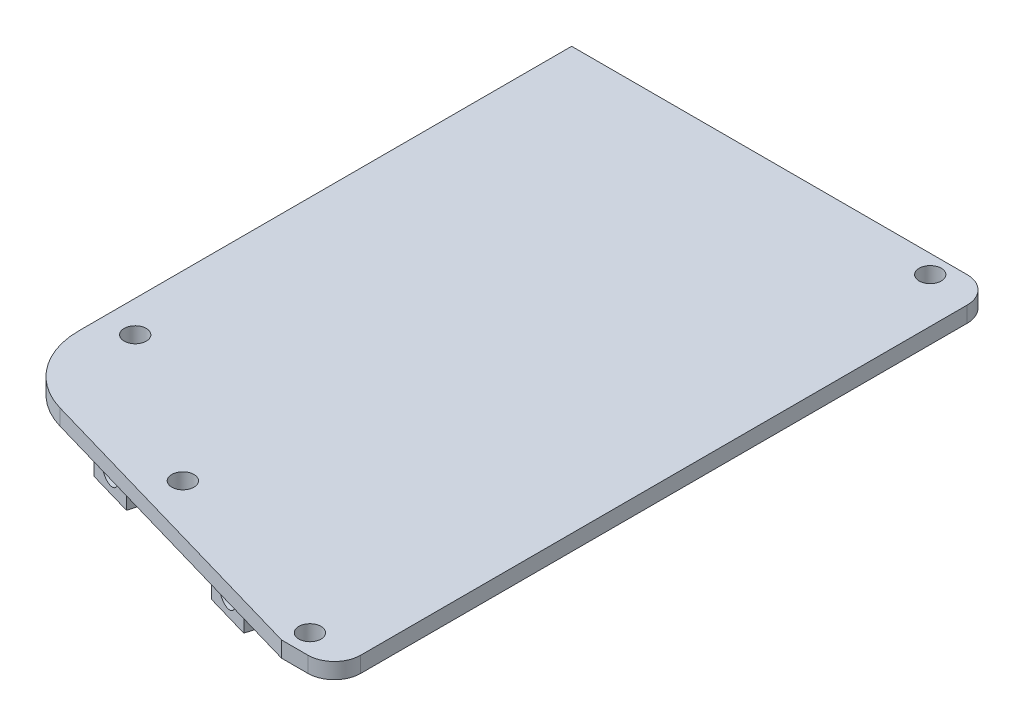
ISO-10303-21;
HEADER;
FILE_DESCRIPTION(('STEP AP214'),'2;1');
FILE_NAME('part.step','',(''),(''),'','','');
FILE_SCHEMA(('AUTOMOTIVE_DESIGN { 1 0 10303 214 1 1 1 1 }'));
ENDSEC;
DATA;
#1=APPLICATION_CONTEXT('core data for automotive mechanical design processes');
#2=APPLICATION_PROTOCOL_DEFINITION('international standard','automotive_design',2000,#1);
#3=PRODUCT_CONTEXT('',#1,'mechanical');
#4=PRODUCT('Part','Part','',(#3));
#5=PRODUCT_RELATED_PRODUCT_CATEGORY('part','',(#4));
#6=PRODUCT_DEFINITION_FORMATION('','',#4);
#7=PRODUCT_DEFINITION_CONTEXT('part definition',#1,'design');
#8=PRODUCT_DEFINITION('design','',#6,#7);
#9=PRODUCT_DEFINITION_SHAPE('','',#8);
#10=(LENGTH_UNIT() NAMED_UNIT(*) SI_UNIT(.MILLI.,.METRE.));
#11=(NAMED_UNIT(*) PLANE_ANGLE_UNIT() SI_UNIT($,.RADIAN.));
#12=(NAMED_UNIT(*) SI_UNIT($,.STERADIAN.) SOLID_ANGLE_UNIT());
#13=UNCERTAINTY_MEASURE_WITH_UNIT(LENGTH_MEASURE(1.E-05),#10,'distance_accuracy_value','');
#14=(GEOMETRIC_REPRESENTATION_CONTEXT(3) GLOBAL_UNCERTAINTY_ASSIGNED_CONTEXT((#13)) GLOBAL_UNIT_ASSIGNED_CONTEXT((#10,
#11,#12)) REPRESENTATION_CONTEXT('',''));
#15=CARTESIAN_POINT('',(0.,0.,0.));
#16=DIRECTION('',(0.,0.,1.));
#17=DIRECTION('',(1.,0.,0.));
#18=AXIS2_PLACEMENT_3D('',#15,#16,#17);
#19=CARTESIAN_POINT('',(-36.2211604368915,-3.5,-95.5775565994307));
#20=DIRECTION('',(0.,0.,1.));
#21=DIRECTION('',(1.,0.,0.));
#22=AXIS2_PLACEMENT_3D('',#19,#20,#21);
#23=CYLINDRICAL_SURFACE('',#22,2.2);
#24=CARTESIAN_POINT('',(-36.2211604368915,-3.5,-87.5775565994307));
#25=DIRECTION('',(0.,0.,1.));
#26=DIRECTION('',(1.,0.,0.));
#27=AXIS2_PLACEMENT_3D('',#24,#25,#26);
#28=CIRCLE('',#27,2.2);
#29=CARTESIAN_POINT('',(-34.0211604368915,-3.5,-87.5775565994307));
#30=VERTEX_POINT('',#29);
#31=EDGE_CURVE('E288',#30,#30,#28,.F.);
#32=ORIENTED_EDGE('',*,*,#31,.F.);
#33=EDGE_LOOP('',(#32));
#34=FACE_BOUND('',#33,.T.);
#35=CARTESIAN_POINT('',(-36.2211604368915,-3.5,-95.5775565994307));
#36=DIRECTION('',(0.,0.,1.));
#37=DIRECTION('',(1.,0.,0.));
#38=AXIS2_PLACEMENT_3D('',#35,#36,#37);
#39=CIRCLE('',#38,2.2);
#40=CARTESIAN_POINT('',(-34.0211604368915,-3.5,-95.5775565994307));
#41=VERTEX_POINT('',#40);
#42=EDGE_CURVE('E20',#41,#41,#39,.T.);
#43=ORIENTED_EDGE('',*,*,#42,.F.);
#44=EDGE_LOOP('',(#43));
#45=FACE_BOUND('',#44,.T.);
#46=ADVANCED_FACE('F17',(#34,#45),#23,.F.);
#47=CARTESIAN_POINT('',(-36.2211604368915,-7.,-91.5775565994307));
#48=DIRECTION('',(0.,-1.,0.));
#49=DIRECTION('',(0.,0.,-1.));
#50=AXIS2_PLACEMENT_3D('',#47,#48,#49);
#51=PLANE('',#50);
#52=DIRECTION('',(1.,0.,0.));
#53=VECTOR('',#52,1.);
#54=CARTESIAN_POINT('',(-31.7211604368915,-7.,-87.5775565994307));
#55=LINE('',#54,#53);
#56=CARTESIAN_POINT('',(-40.7211604368915,-7.,-87.5775565994307));
#57=VERTEX_POINT('',#56);
#58=CARTESIAN_POINT('',(-31.7211604368915,-7.,-87.5775565994307));
#59=VERTEX_POINT('',#58);
#60=EDGE_CURVE('E204',#57,#59,#55,.T.);
#61=ORIENTED_EDGE('',*,*,#60,.F.);
#62=DIRECTION('',(0.,0.,1.));
#63=VECTOR('',#62,1.);
#64=CARTESIAN_POINT('',(-40.7211604368915,-7.,-87.5775565994307));
#65=LINE('',#64,#63);
#66=CARTESIAN_POINT('',(-40.7211604368915,-7.,-95.5775565994307));
#67=VERTEX_POINT('',#66);
#68=EDGE_CURVE('E193',#67,#57,#65,.T.);
#69=ORIENTED_EDGE('',*,*,#68,.F.);
#70=DIRECTION('',(-1.,0.,0.));
#71=VECTOR('',#70,1.);
#72=CARTESIAN_POINT('',(-40.7211604368915,-7.,-95.5775565994307));
#73=LINE('',#72,#71);
#74=CARTESIAN_POINT('',(-31.7211604368915,-7.,-95.5775565994307));
#75=VERTEX_POINT('',#74);
#76=EDGE_CURVE('E186',#75,#67,#73,.T.);
#77=ORIENTED_EDGE('',*,*,#76,.F.);
#78=DIRECTION('',(0.,0.,-1.));
#79=VECTOR('',#78,1.);
#80=CARTESIAN_POINT('',(-31.7211604368915,-7.,-95.5775565994307));
#81=LINE('',#80,#79);
#82=EDGE_CURVE('E190',#59,#75,#81,.T.);
#83=ORIENTED_EDGE('',*,*,#82,.F.);
#84=EDGE_LOOP('',(#61,#69,#77,#83));
#85=FACE_BOUND('',#84,.T.);
#86=ADVANCED_FACE('F188',(#85),#51,.T.);
#87=CARTESIAN_POINT('',(-40.2439473426353,-3.5,17.4907953480703));
#88=DIRECTION('',(0.2778678402913,0.,-0.960619312387508));
#89=DIRECTION('',(-0.960619312387508,0.,-0.2778678402913));
#90=AXIS2_PLACEMENT_3D('',#87,#88,#89);
#91=CYLINDRICAL_SURFACE('',#90,2.2);
#92=CARTESIAN_POINT('',(-38.0210046203049,-3.5,9.80584084897022));
#93=DIRECTION('',(0.2778678402913,0.,-0.960619312387508));
#94=DIRECTION('',(-0.960619312387508,0.,-0.2778678402913));
#95=AXIS2_PLACEMENT_3D('',#92,#93,#94);
#96=CIRCLE('',#95,2.2);
#97=CARTESIAN_POINT('',(-40.1343671075574,-3.5,9.19453160032936));
#98=VERTEX_POINT('',#97);
#99=EDGE_CURVE('E284',#98,#98,#96,.F.);
#100=ORIENTED_EDGE('',*,*,#99,.F.);
#101=EDGE_LOOP('',(#100));
#102=FACE_BOUND('',#101,.T.);
#103=CARTESIAN_POINT('',(-40.2439473426353,-3.5,17.4907953480703));
#104=DIRECTION('',(0.2778678402913,0.,-0.960619312387508));
#105=DIRECTION('',(-0.960619312387508,0.,-0.2778678402913));
#106=AXIS2_PLACEMENT_3D('',#103,#104,#105);
#107=CIRCLE('',#106,2.2);
#108=CARTESIAN_POINT('',(-42.3573098298878,-3.5,16.8794860994294));
#109=VERTEX_POINT('',#108);
#110=EDGE_CURVE('E279',#109,#109,#107,.T.);
#111=ORIENTED_EDGE('',*,*,#110,.F.);
#112=EDGE_LOOP('',(#111));
#113=FACE_BOUND('',#112,.T.);
#114=ADVANCED_FACE('F571',(#102,#113),#91,.F.);
#115=CARTESIAN_POINT('',(-39.1324759814701,-7.,13.6483180985203));
#116=DIRECTION('',(0.,-1.,0.));
#117=DIRECTION('',(0.,0.,-1.));
#118=AXIS2_PLACEMENT_3D('',#115,#116,#117);
#119=PLANE('',#118);
#120=DIRECTION('',(0.960619312387508,0.,0.2778678402913));
#121=VECTOR('',#120,1.);
#122=CARTESIAN_POINT('',(-35.9211604368915,-7.,18.7412006293812));
#123=LINE('',#122,#121);
#124=CARTESIAN_POINT('',(-44.5667342483791,-7.,16.2403900667594));
#125=VERTEX_POINT('',#124);
#126=CARTESIAN_POINT('',(-35.9211604368915,-7.,18.7412006293811));
#127=VERTEX_POINT('',#126);
#128=EDGE_CURVE('E308',#125,#127,#123,.T.);
#129=ORIENTED_EDGE('',*,*,#128,.F.);
#130=DIRECTION('',(-0.277867840291301,0.,0.960619312387508));
#131=VECTOR('',#130,1.);
#132=CARTESIAN_POINT('',(-44.5667342483791,-7.,16.2403900667594));
#133=LINE('',#132,#131);
#134=CARTESIAN_POINT('',(-42.3437915260487,-7.,8.55543556765939));
#135=VERTEX_POINT('',#134);
#136=EDGE_CURVE('E315',#135,#125,#133,.T.);
#137=ORIENTED_EDGE('',*,*,#136,.F.);
#138=DIRECTION('',(-0.960619312387508,0.,-0.2778678402913));
#139=VECTOR('',#138,1.);
#140=CARTESIAN_POINT('',(-42.3437915260487,-7.,8.55543556765939));
#141=LINE('',#140,#139);
#142=CARTESIAN_POINT('',(-33.6982177145611,-7.,11.0562461302811));
#143=VERTEX_POINT('',#142);
#144=EDGE_CURVE('E287',#143,#135,#141,.T.);
#145=ORIENTED_EDGE('',*,*,#144,.F.);
#146=DIRECTION('',(0.2778678402913,0.,-0.960619312387508));
#147=VECTOR('',#146,1.);
#148=CARTESIAN_POINT('',(-33.6982177145611,-7.,11.0562461302811));
#149=LINE('',#148,#147);
#150=EDGE_CURVE('E286',#127,#143,#149,.T.);
#151=ORIENTED_EDGE('',*,*,#150,.F.);
#152=EDGE_LOOP('',(#129,#137,#145,#151));
#153=FACE_BOUND('',#152,.T.);
#154=ADVANCED_FACE('F567',(#153),#119,.T.);
#155=CARTESIAN_POINT('',(-83.9711604368915,-7.,-46.8785565994307));
#156=DIRECTION('',(0.,-1.,0.));
#157=DIRECTION('',(0.,0.,-1.));
#158=AXIS2_PLACEMENT_3D('',#155,#156,#157);
#159=PLANE('',#158);
#160=DIRECTION('',(-1.,0.,0.));
#161=VECTOR('',#160,1.);
#162=CARTESIAN_POINT('',(-87.9711604368915,-7.,-51.3785565994307));
#163=LINE('',#162,#161);
#164=CARTESIAN_POINT('',(-79.9711604368915,-7.,-51.3785565994307));
#165=VERTEX_POINT('',#164);
#166=CARTESIAN_POINT('',(-87.9711604368915,-7.,-51.3785565994307));
#167=VERTEX_POINT('',#166);
#168=EDGE_CURVE('E277',#165,#167,#163,.T.);
#169=ORIENTED_EDGE('',*,*,#168,.F.);
#170=DIRECTION('',(0.,0.,-1.));
#171=VECTOR('',#170,1.);
#172=CARTESIAN_POINT('',(-79.9711604368915,-7.,-51.3785565994307));
#173=LINE('',#172,#171);
#174=CARTESIAN_POINT('',(-79.9711604368915,-7.,-42.3785565994307));
#175=VERTEX_POINT('',#174);
#176=EDGE_CURVE('E336',#175,#165,#173,.T.);
#177=ORIENTED_EDGE('',*,*,#176,.F.);
#178=DIRECTION('',(1.,0.,0.));
#179=VECTOR('',#178,1.);
#180=CARTESIAN_POINT('',(-79.9711604368915,-7.,-42.3785565994307));
#181=LINE('',#180,#179);
#182=CARTESIAN_POINT('',(-87.9711604368915,-7.,-42.3785565994307));
#183=VERTEX_POINT('',#182);
#184=EDGE_CURVE('E321',#183,#175,#181,.T.);
#185=ORIENTED_EDGE('',*,*,#184,.F.);
#186=DIRECTION('',(0.,0.,1.));
#187=VECTOR('',#186,1.);
#188=CARTESIAN_POINT('',(-87.9711604368915,-7.,-42.3785565994307));
#189=LINE('',#188,#187);
#190=EDGE_CURVE('E323',#167,#183,#189,.T.);
#191=ORIENTED_EDGE('',*,*,#190,.F.);
#192=EDGE_LOOP('',(#169,#177,#185,#191));
#193=FACE_BOUND('',#192,.T.);
#194=ADVANCED_FACE('F563',(#193),#159,.T.);
#195=CARTESIAN_POINT('',(-87.9711604368915,-3.5,-46.8785565994307));
#196=DIRECTION('',(1.,0.,0.));
#197=DIRECTION('',(0.,0.,-1.));
#198=AXIS2_PLACEMENT_3D('',#195,#196,#197);
#199=CYLINDRICAL_SURFACE('',#198,2.2);
#200=CARTESIAN_POINT('',(-79.9711604368915,-3.5,-46.8785565994307));
#201=DIRECTION('',(1.,0.,0.));
#202=DIRECTION('',(0.,0.,-1.));
#203=AXIS2_PLACEMENT_3D('',#200,#201,#202);
#204=CIRCLE('',#203,2.2);
#205=CARTESIAN_POINT('',(-79.9711604368915,-3.5,-49.0785565994307));
#206=VERTEX_POINT('',#205);
#207=EDGE_CURVE('E270',#206,#206,#204,.F.);
#208=ORIENTED_EDGE('',*,*,#207,.F.);
#209=EDGE_LOOP('',(#208));
#210=FACE_BOUND('',#209,.T.);
#211=CARTESIAN_POINT('',(-87.9711604368915,-3.5,-46.8785565994307));
#212=DIRECTION('',(1.,0.,0.));
#213=DIRECTION('',(0.,0.,-1.));
#214=AXIS2_PLACEMENT_3D('',#211,#212,#213);
#215=CIRCLE('',#214,2.2);
#216=CARTESIAN_POINT('',(-87.9711604368915,-3.5,-49.0785565994307));
#217=VERTEX_POINT('',#216);
#218=EDGE_CURVE('E274',#217,#217,#215,.T.);
#219=ORIENTED_EDGE('',*,*,#218,.F.);
#220=EDGE_LOOP('',(#219));
#221=FACE_BOUND('',#220,.T.);
#222=ADVANCED_FACE('F559',(#210,#221),#199,.F.);
#223=CARTESIAN_POINT('',(-71.5439473426353,-3.5,8.43698673839156));
#224=DIRECTION('',(0.2778678402913,0.,-0.960619312387508));
#225=DIRECTION('',(-0.960619312387508,0.,-0.2778678402913));
#226=AXIS2_PLACEMENT_3D('',#223,#224,#225);
#227=CYLINDRICAL_SURFACE('',#226,2.2);
#228=CARTESIAN_POINT('',(-69.3210046203049,-3.5,0.752032239291493));
#229=DIRECTION('',(0.2778678402913,0.,-0.960619312387508));
#230=DIRECTION('',(-0.960619312387508,0.,-0.2778678402913));
#231=AXIS2_PLACEMENT_3D('',#228,#229,#230);
#232=CIRCLE('',#231,2.2);
#233=CARTESIAN_POINT('',(-71.4343671075574,-3.5,0.140722990650632));
#234=VERTEX_POINT('',#233);
#235=EDGE_CURVE('E265',#234,#234,#232,.F.);
#236=ORIENTED_EDGE('',*,*,#235,.F.);
#237=EDGE_LOOP('',(#236));
#238=FACE_BOUND('',#237,.T.);
#239=CARTESIAN_POINT('',(-71.5439473426353,-3.5,8.43698673839156));
#240=DIRECTION('',(0.2778678402913,0.,-0.960619312387508));
#241=DIRECTION('',(-0.960619312387508,0.,-0.2778678402913));
#242=AXIS2_PLACEMENT_3D('',#239,#240,#241);
#243=CIRCLE('',#242,2.2);
#244=CARTESIAN_POINT('',(-73.6573098298878,-3.5,7.8256774897507));
#245=VERTEX_POINT('',#244);
#246=EDGE_CURVE('E260',#245,#245,#243,.T.);
#247=ORIENTED_EDGE('',*,*,#246,.F.);
#248=EDGE_LOOP('',(#247));
#249=FACE_BOUND('',#248,.T.);
#250=ADVANCED_FACE('F555',(#238,#249),#227,.F.);
#251=CARTESIAN_POINT('',(-70.4324759814701,-7.,4.59450948884153));
#252=DIRECTION('',(0.,-1.,0.));
#253=DIRECTION('',(0.,0.,-1.));
#254=AXIS2_PLACEMENT_3D('',#251,#252,#253);
#255=PLANE('',#254);
#256=DIRECTION('',(0.960619312387508,0.,0.2778678402913));
#257=VECTOR('',#256,1.);
#258=CARTESIAN_POINT('',(-67.2211604368915,-7.,9.68739201970241));
#259=LINE('',#258,#257);
#260=CARTESIAN_POINT('',(-75.8667342483791,-7.,7.18658145708071));
#261=VERTEX_POINT('',#260);
#262=CARTESIAN_POINT('',(-67.2211604368915,-7.,9.68739201970241));
#263=VERTEX_POINT('',#262);
#264=EDGE_CURVE('E347',#261,#263,#259,.T.);
#265=ORIENTED_EDGE('',*,*,#264,.F.);
#266=DIRECTION('',(-0.2778678402913,0.,0.960619312387508));
#267=VECTOR('',#266,1.);
#268=CARTESIAN_POINT('',(-75.8667342483791,-7.,7.18658145708071));
#269=LINE('',#268,#267);
#270=CARTESIAN_POINT('',(-73.6437915260487,-7.,-0.498373042019354));
#271=VERTEX_POINT('',#270);
#272=EDGE_CURVE('E353',#271,#261,#269,.T.);
#273=ORIENTED_EDGE('',*,*,#272,.F.);
#274=DIRECTION('',(-0.960619312387508,0.,-0.2778678402913));
#275=VECTOR('',#274,1.);
#276=CARTESIAN_POINT('',(-73.6437915260487,-7.,-0.498373042019354));
#277=LINE('',#276,#275);
#278=CARTESIAN_POINT('',(-64.9982177145611,-7.,2.00243752060235));
#279=VERTEX_POINT('',#278);
#280=EDGE_CURVE('E269',#279,#271,#277,.T.);
#281=ORIENTED_EDGE('',*,*,#280,.F.);
#282=DIRECTION('',(0.277867840291299,0.,-0.960619312387508));
#283=VECTOR('',#282,1.);
#284=CARTESIAN_POINT('',(-64.9982177145611,-7.,2.00243752060235));
#285=LINE('',#284,#283);
#286=EDGE_CURVE('E268',#263,#279,#285,.T.);
#287=ORIENTED_EDGE('',*,*,#286,.F.);
#288=EDGE_LOOP('',(#265,#273,#281,#287));
#289=FACE_BOUND('',#288,.T.);
#290=ADVANCED_FACE('F551',(#289),#255,.T.);
#291=CARTESIAN_POINT('',(-40.7211604368915,0.,-95.5775565994307));
#292=DIRECTION('',(0.,0.,-1.));
#293=DIRECTION('',(-1.,0.,0.));
#294=AXIS2_PLACEMENT_3D('',#291,#292,#293);
#295=PLANE('',#294);
#296=ORIENTED_EDGE('',*,*,#42,.T.);
#297=EDGE_LOOP('',(#296));
#298=FACE_BOUND('',#297,.T.);
#299=ORIENTED_EDGE('',*,*,#76,.T.);
#300=DIRECTION('',(0.,1.,0.));
#301=VECTOR('',#300,1.);
#302=CARTESIAN_POINT('',(-40.7211604368915,0.,-95.5775565994307));
#303=LINE('',#302,#301);
#304=CARTESIAN_POINT('',(-40.7211604368915,0.,-95.5775565994307));
#305=VERTEX_POINT('',#304);
#306=EDGE_CURVE('E290',#305,#67,#303,.F.);
#307=ORIENTED_EDGE('',*,*,#306,.F.);
#308=DIRECTION('',(1.,0.,0.));
#309=VECTOR('',#308,1.);
#310=CARTESIAN_POINT('',(-51.2211604368915,0.,-95.5775565994307));
#311=LINE('',#310,#309);
#312=CARTESIAN_POINT('',(-31.7211604368915,0.,-95.5775565994307));
#313=VERTEX_POINT('',#312);
#314=EDGE_CURVE('E201',#305,#313,#311,.T.);
#315=ORIENTED_EDGE('',*,*,#314,.T.);
#316=DIRECTION('',(0.,1.,0.));
#317=VECTOR('',#316,1.);
#318=CARTESIAN_POINT('',(-31.7211604368915,0.,-95.5775565994307));
#319=LINE('',#318,#317);
#320=EDGE_CURVE('E198',#75,#313,#319,.T.);
#321=ORIENTED_EDGE('',*,*,#320,.F.);
#322=EDGE_LOOP('',(#299,#307,#315,#321));
#323=FACE_BOUND('',#322,.T.);
#324=ADVANCED_FACE('F199',(#298,#323),#295,.T.);
#325=CARTESIAN_POINT('',(-31.7211604368915,0.,-95.5775565994307));
#326=DIRECTION('',(1.,0.,0.));
#327=DIRECTION('',(0.,0.,-1.));
#328=AXIS2_PLACEMENT_3D('',#325,#326,#327);
#329=PLANE('',#328);
#330=ORIENTED_EDGE('',*,*,#82,.T.);
#331=ORIENTED_EDGE('',*,*,#320,.T.);
#332=DIRECTION('',(0.,0.,1.));
#333=VECTOR('',#332,1.);
#334=CARTESIAN_POINT('',(-31.7211604368915,0.,-36.2275565994307));
#335=LINE('',#334,#333);
#336=CARTESIAN_POINT('',(-31.7211604368915,0.,-87.5775565994307));
#337=VERTEX_POINT('',#336);
#338=EDGE_CURVE('E383',#313,#337,#335,.T.);
#339=ORIENTED_EDGE('',*,*,#338,.T.);
#340=DIRECTION('',(0.,1.,0.));
#341=VECTOR('',#340,1.);
#342=CARTESIAN_POINT('',(-31.7211604368915,0.,-87.5775565994307));
#343=LINE('',#342,#341);
#344=EDGE_CURVE('E208',#59,#337,#343,.T.);
#345=ORIENTED_EDGE('',*,*,#344,.F.);
#346=EDGE_LOOP('',(#330,#331,#339,#345));
#347=FACE_BOUND('',#346,.T.);
#348=ADVANCED_FACE('F206',(#347),#329,.T.);
#349=CARTESIAN_POINT('',(-31.7211604368915,0.,-87.5775565994307));
#350=DIRECTION('',(0.,0.,1.));
#351=DIRECTION('',(1.,0.,0.));
#352=AXIS2_PLACEMENT_3D('',#349,#350,#351);
#353=PLANE('',#352);
#354=ORIENTED_EDGE('',*,*,#31,.T.);
#355=EDGE_LOOP('',(#354));
#356=FACE_BOUND('',#355,.T.);
#357=ORIENTED_EDGE('',*,*,#60,.T.);
#358=ORIENTED_EDGE('',*,*,#344,.T.);
#359=DIRECTION('',(1.,0.,0.));
#360=VECTOR('',#359,1.);
#361=CARTESIAN_POINT('',(-51.2211604368915,0.,-87.5775565994307));
#362=LINE('',#361,#360);
#363=CARTESIAN_POINT('',(-40.7211604368915,0.,-87.5775565994307));
#364=VERTEX_POINT('',#363);
#365=EDGE_CURVE('E385',#337,#364,#362,.F.);
#366=ORIENTED_EDGE('',*,*,#365,.T.);
#367=DIRECTION('',(0.,1.,0.));
#368=VECTOR('',#367,1.);
#369=CARTESIAN_POINT('',(-40.7211604368915,0.,-87.5775565994307));
#370=LINE('',#369,#368);
#371=EDGE_CURVE('E299',#57,#364,#370,.T.);
#372=ORIENTED_EDGE('',*,*,#371,.F.);
#373=EDGE_LOOP('',(#357,#358,#366,#372));
#374=FACE_BOUND('',#373,.T.);
#375=ADVANCED_FACE('F531',(#356,#374),#353,.T.);
#376=CARTESIAN_POINT('',(-40.7211604368915,0.,-87.5775565994307));
#377=DIRECTION('',(-1.,0.,0.));
#378=DIRECTION('',(0.,0.,1.));
#379=AXIS2_PLACEMENT_3D('',#376,#377,#378);
#380=PLANE('',#379);
#381=ORIENTED_EDGE('',*,*,#68,.T.);
#382=ORIENTED_EDGE('',*,*,#371,.T.);
#383=DIRECTION('',(0.,0.,1.));
#384=VECTOR('',#383,1.);
#385=CARTESIAN_POINT('',(-40.7211604368915,0.,-36.2275565994307));
#386=LINE('',#385,#384);
#387=EDGE_CURVE('E387',#364,#305,#386,.F.);
#388=ORIENTED_EDGE('',*,*,#387,.T.);
#389=ORIENTED_EDGE('',*,*,#306,.T.);
#390=EDGE_LOOP('',(#381,#382,#388,#389));
#391=FACE_BOUND('',#390,.T.);
#392=ADVANCED_FACE('F533',(#391),#380,.T.);
#393=CARTESIAN_POINT('',(-42.3437915260487,0.,8.55543556765939));
#394=DIRECTION('',(0.2778678402913,0.,-0.960619312387508));
#395=DIRECTION('',(-0.960619312387508,0.,-0.2778678402913));
#396=AXIS2_PLACEMENT_3D('',#393,#394,#395);
#397=PLANE('',#396);
#398=ORIENTED_EDGE('',*,*,#99,.T.);
#399=EDGE_LOOP('',(#398));
#400=FACE_BOUND('',#399,.T.);
#401=ORIENTED_EDGE('',*,*,#144,.T.);
#402=DIRECTION('',(0.,1.,0.));
#403=VECTOR('',#402,1.);
#404=CARTESIAN_POINT('',(-42.3437915260487,0.,8.55543556765939));
#405=LINE('',#404,#403);
#406=CARTESIAN_POINT('',(-42.3437915260487,0.,8.55543556765939));
#407=VERTEX_POINT('',#406);
#408=EDGE_CURVE('E282',#407,#135,#405,.F.);
#409=ORIENTED_EDGE('',*,*,#408,.F.);
#410=DIRECTION('',(0.960619312387508,0.,0.2778678402913));
#411=VECTOR('',#410,1.);
#412=CARTESIAN_POINT('',(-42.3437915260487,0.,8.55543556765939));
#413=LINE('',#412,#411);
#414=CARTESIAN_POINT('',(-33.6982177145611,0.,11.0562461302811));
#415=VERTEX_POINT('',#414);
#416=EDGE_CURVE('E390',#407,#415,#413,.T.);
#417=ORIENTED_EDGE('',*,*,#416,.T.);
#418=DIRECTION('',(0.,1.,0.));
#419=VECTOR('',#418,1.);
#420=CARTESIAN_POINT('',(-33.6982177145611,0.,11.0562461302811));
#421=LINE('',#420,#419);
#422=EDGE_CURVE('E305',#143,#415,#421,.T.);
#423=ORIENTED_EDGE('',*,*,#422,.F.);
#424=EDGE_LOOP('',(#401,#409,#417,#423));
#425=FACE_BOUND('',#424,.T.);
#426=ADVANCED_FACE('F535',(#400,#425),#397,.T.);
#427=CARTESIAN_POINT('',(-33.6982177145611,0.,11.0562461302811));
#428=DIRECTION('',(0.960619312387508,0.,0.2778678402913));
#429=DIRECTION('',(0.2778678402913,0.,-0.960619312387508));
#430=AXIS2_PLACEMENT_3D('',#427,#428,#429);
#431=PLANE('',#430);
#432=ORIENTED_EDGE('',*,*,#150,.T.);
#433=ORIENTED_EDGE('',*,*,#422,.T.);
#434=DIRECTION('',(-0.277867840291297,0.,0.960619312387509));
#435=VECTOR('',#434,1.);
#436=CARTESIAN_POINT('',(-33.6982177145611,0.,11.0562461302811));
#437=LINE('',#436,#435);
#438=CARTESIAN_POINT('',(-35.9211604368915,0.,18.7412006293812));
#439=VERTEX_POINT('',#438);
#440=EDGE_CURVE('E392',#415,#439,#437,.T.);
#441=ORIENTED_EDGE('',*,*,#440,.T.);
#442=DIRECTION('',(0.,1.,0.));
#443=VECTOR('',#442,1.);
#444=CARTESIAN_POINT('',(-35.9211604368915,0.,18.7412006293812));
#445=LINE('',#444,#443);
#446=EDGE_CURVE('E283',#127,#439,#445,.T.);
#447=ORIENTED_EDGE('',*,*,#446,.F.);
#448=EDGE_LOOP('',(#432,#433,#441,#447));
#449=FACE_BOUND('',#448,.T.);
#450=ADVANCED_FACE('F541',(#449),#431,.T.);
#451=CARTESIAN_POINT('',(-35.9211604368915,0.,18.7412006293812));
#452=DIRECTION('',(-0.2778678402913,0.,0.960619312387508));
#453=DIRECTION('',(0.960619312387508,0.,0.2778678402913));
#454=AXIS2_PLACEMENT_3D('',#451,#452,#453);
#455=PLANE('',#454);
#456=ORIENTED_EDGE('',*,*,#110,.T.);
#457=EDGE_LOOP('',(#456));
#458=FACE_BOUND('',#457,.T.);
#459=ORIENTED_EDGE('',*,*,#128,.T.);
#460=ORIENTED_EDGE('',*,*,#446,.T.);
#461=DIRECTION('',(-0.960619312387505,0.,-0.277867840291309));
#462=VECTOR('',#461,1.);
#463=CARTESIAN_POINT('',(-35.9211604368915,0.,18.7412006293812));
#464=LINE('',#463,#462);
#465=CARTESIAN_POINT('',(-44.5667342483791,0.,16.2403900667594));
#466=VERTEX_POINT('',#465);
#467=EDGE_CURVE('E394',#439,#466,#464,.T.);
#468=ORIENTED_EDGE('',*,*,#467,.T.);
#469=DIRECTION('',(0.,1.,0.));
#470=VECTOR('',#469,1.);
#471=CARTESIAN_POINT('',(-44.5667342483791,0.,16.2403900667594));
#472=LINE('',#471,#470);
#473=EDGE_CURVE('E318',#125,#466,#472,.T.);
#474=ORIENTED_EDGE('',*,*,#473,.F.);
#475=EDGE_LOOP('',(#459,#460,#468,#474));
#476=FACE_BOUND('',#475,.T.);
#477=ADVANCED_FACE('F666',(#458,#476),#455,.T.);
#478=CARTESIAN_POINT('',(-44.5667342483791,0.,16.2403900667594));
#479=DIRECTION('',(-0.960619312387508,0.,-0.277867840291301));
#480=DIRECTION('',(-0.277867840291301,0.,0.960619312387508));
#481=AXIS2_PLACEMENT_3D('',#478,#479,#480);
#482=PLANE('',#481);
#483=ORIENTED_EDGE('',*,*,#136,.T.);
#484=ORIENTED_EDGE('',*,*,#473,.T.);
#485=DIRECTION('',(0.277867840291302,0.,-0.960619312387507));
#486=VECTOR('',#485,1.);
#487=CARTESIAN_POINT('',(-44.5667342483791,0.,16.2403900667594));
#488=LINE('',#487,#486);
#489=EDGE_CURVE('E396',#466,#407,#488,.T.);
#490=ORIENTED_EDGE('',*,*,#489,.T.);
#491=ORIENTED_EDGE('',*,*,#408,.T.);
#492=EDGE_LOOP('',(#483,#484,#490,#491));
#493=FACE_BOUND('',#492,.T.);
#494=ADVANCED_FACE('F675',(#493),#482,.T.);
#495=CARTESIAN_POINT('',(-79.9711604368915,0.,-42.3785565994307));
#496=DIRECTION('',(0.,0.,1.));
#497=DIRECTION('',(1.,0.,0.));
#498=AXIS2_PLACEMENT_3D('',#495,#496,#497);
#499=PLANE('',#498);
#500=ORIENTED_EDGE('',*,*,#184,.T.);
#501=DIRECTION('',(0.,1.,0.));
#502=VECTOR('',#501,1.);
#503=CARTESIAN_POINT('',(-79.9711604368915,0.,-42.3785565994307));
#504=LINE('',#503,#502);
#505=CARTESIAN_POINT('',(-79.9711604368915,0.,-42.3785565994307));
#506=VERTEX_POINT('',#505);
#507=EDGE_CURVE('E333',#506,#175,#504,.F.);
#508=ORIENTED_EDGE('',*,*,#507,.F.);
#509=DIRECTION('',(1.,0.,0.));
#510=VECTOR('',#509,1.);
#511=CARTESIAN_POINT('',(-51.2211604368915,0.,-42.3785565994307));
#512=LINE('',#511,#510);
#513=CARTESIAN_POINT('',(-87.9711604368915,0.,-42.3785565994307));
#514=VERTEX_POINT('',#513);
#515=EDGE_CURVE('E399',#506,#514,#512,.F.);
#516=ORIENTED_EDGE('',*,*,#515,.T.);
#517=DIRECTION('',(0.,1.,0.));
#518=VECTOR('',#517,1.);
#519=CARTESIAN_POINT('',(-87.9711604368915,0.,-42.3785565994307));
#520=LINE('',#519,#518);
#521=EDGE_CURVE('E278',#183,#514,#520,.T.);
#522=ORIENTED_EDGE('',*,*,#521,.F.);
#523=EDGE_LOOP('',(#500,#508,#516,#522));
#524=FACE_BOUND('',#523,.T.);
#525=ADVANCED_FACE('F685',(#524),#499,.T.);
#526=CARTESIAN_POINT('',(-87.9711604368915,0.,-42.3785565994307));
#527=DIRECTION('',(-1.,0.,0.));
#528=DIRECTION('',(0.,0.,1.));
#529=AXIS2_PLACEMENT_3D('',#526,#527,#528);
#530=PLANE('',#529);
#531=ORIENTED_EDGE('',*,*,#218,.T.);
#532=EDGE_LOOP('',(#531));
#533=FACE_BOUND('',#532,.T.);
#534=ORIENTED_EDGE('',*,*,#190,.T.);
#535=ORIENTED_EDGE('',*,*,#521,.T.);
#536=DIRECTION('',(0.,0.,1.));
#537=VECTOR('',#536,1.);
#538=CARTESIAN_POINT('',(-87.9711604368915,0.,-36.2275565994307));
#539=LINE('',#538,#537);
#540=CARTESIAN_POINT('',(-87.9711604368915,0.,-51.3785565994307));
#541=VERTEX_POINT('',#540);
#542=EDGE_CURVE('E401',#514,#541,#539,.F.);
#543=ORIENTED_EDGE('',*,*,#542,.T.);
#544=DIRECTION('',(0.,1.,0.));
#545=VECTOR('',#544,1.);
#546=CARTESIAN_POINT('',(-87.9711604368915,0.,-51.3785565994307));
#547=LINE('',#546,#545);
#548=EDGE_CURVE('E330',#167,#541,#547,.T.);
#549=ORIENTED_EDGE('',*,*,#548,.F.);
#550=EDGE_LOOP('',(#534,#535,#543,#549));
#551=FACE_BOUND('',#550,.T.);
#552=ADVANCED_FACE('F695',(#533,#551),#530,.T.);
#553=CARTESIAN_POINT('',(-87.9711604368915,0.,-51.3785565994307));
#554=DIRECTION('',(0.,0.,-1.));
#555=DIRECTION('',(-1.,0.,0.));
#556=AXIS2_PLACEMENT_3D('',#553,#554,#555);
#557=PLANE('',#556);
#558=ORIENTED_EDGE('',*,*,#168,.T.);
#559=ORIENTED_EDGE('',*,*,#548,.T.);
#560=DIRECTION('',(1.,0.,0.));
#561=VECTOR('',#560,1.);
#562=CARTESIAN_POINT('',(-51.2211604368915,0.,-51.3785565994307));
#563=LINE('',#562,#561);
#564=CARTESIAN_POINT('',(-79.9711604368915,0.,-51.3785565994307));
#565=VERTEX_POINT('',#564);
#566=EDGE_CURVE('E403',#541,#565,#563,.T.);
#567=ORIENTED_EDGE('',*,*,#566,.T.);
#568=DIRECTION('',(0.,1.,0.));
#569=VECTOR('',#568,1.);
#570=CARTESIAN_POINT('',(-79.9711604368915,0.,-51.3785565994307));
#571=LINE('',#570,#569);
#572=EDGE_CURVE('E273',#165,#565,#571,.T.);
#573=ORIENTED_EDGE('',*,*,#572,.F.);
#574=EDGE_LOOP('',(#558,#559,#567,#573));
#575=FACE_BOUND('',#574,.T.);
#576=ADVANCED_FACE('F705',(#575),#557,.T.);
#577=CARTESIAN_POINT('',(-79.9711604368915,0.,-51.3785565994307));
#578=DIRECTION('',(1.,0.,0.));
#579=DIRECTION('',(0.,0.,-1.));
#580=AXIS2_PLACEMENT_3D('',#577,#578,#579);
#581=PLANE('',#580);
#582=ORIENTED_EDGE('',*,*,#207,.T.);
#583=EDGE_LOOP('',(#582));
#584=FACE_BOUND('',#583,.T.);
#585=ORIENTED_EDGE('',*,*,#176,.T.);
#586=ORIENTED_EDGE('',*,*,#572,.T.);
#587=DIRECTION('',(0.,0.,1.));
#588=VECTOR('',#587,1.);
#589=CARTESIAN_POINT('',(-79.9711604368915,0.,-36.2275565994307));
#590=LINE('',#589,#588);
#591=EDGE_CURVE('E405',#565,#506,#590,.T.);
#592=ORIENTED_EDGE('',*,*,#591,.T.);
#593=ORIENTED_EDGE('',*,*,#507,.T.);
#594=EDGE_LOOP('',(#585,#586,#592,#593));
#595=FACE_BOUND('',#594,.T.);
#596=ADVANCED_FACE('F715',(#584,#595),#581,.T.);
#597=CARTESIAN_POINT('',(-73.6437915260487,0.,-0.498373042019354));
#598=DIRECTION('',(0.2778678402913,0.,-0.960619312387508));
#599=DIRECTION('',(-0.960619312387508,0.,-0.2778678402913));
#600=AXIS2_PLACEMENT_3D('',#597,#598,#599);
#601=PLANE('',#600);
#602=ORIENTED_EDGE('',*,*,#235,.T.);
#603=EDGE_LOOP('',(#602));
#604=FACE_BOUND('',#603,.T.);
#605=ORIENTED_EDGE('',*,*,#280,.T.);
#606=DIRECTION('',(0.,1.,0.));
#607=VECTOR('',#606,1.);
#608=CARTESIAN_POINT('',(-73.6437915260487,0.,-0.498373042019352));
#609=LINE('',#608,#607);
#610=CARTESIAN_POINT('',(-73.6437915260487,0.,-0.498373042019354));
#611=VERTEX_POINT('',#610);
#612=EDGE_CURVE('E263',#611,#271,#609,.F.);
#613=ORIENTED_EDGE('',*,*,#612,.F.);
#614=DIRECTION('',(0.960619312387508,0.,0.277867840291299));
#615=VECTOR('',#614,1.);
#616=CARTESIAN_POINT('',(-73.6437915260487,0.,-0.498373042019357));
#617=LINE('',#616,#615);
#618=CARTESIAN_POINT('',(-64.9982177145611,0.,2.00243752060235));
#619=VERTEX_POINT('',#618);
#620=EDGE_CURVE('E408',#611,#619,#617,.T.);
#621=ORIENTED_EDGE('',*,*,#620,.T.);
#622=DIRECTION('',(0.,1.,0.));
#623=VECTOR('',#622,1.);
#624=CARTESIAN_POINT('',(-64.9982177145611,0.,2.00243752060235));
#625=LINE('',#624,#623);
#626=EDGE_CURVE('E344',#279,#619,#625,.T.);
#627=ORIENTED_EDGE('',*,*,#626,.F.);
#628=EDGE_LOOP('',(#605,#613,#621,#627));
#629=FACE_BOUND('',#628,.T.);
#630=ADVANCED_FACE('F725',(#604,#629),#601,.T.);
#631=CARTESIAN_POINT('',(-64.9982177145611,0.,2.00243752060235));
#632=DIRECTION('',(0.960619312387508,0.,0.277867840291299));
#633=DIRECTION('',(0.277867840291299,0.,-0.960619312387508));
#634=AXIS2_PLACEMENT_3D('',#631,#632,#633);
#635=PLANE('',#634);
#636=ORIENTED_EDGE('',*,*,#286,.T.);
#637=ORIENTED_EDGE('',*,*,#626,.T.);
#638=DIRECTION('',(-0.277867840291301,0.,0.960619312387508));
#639=VECTOR('',#638,1.);
#640=CARTESIAN_POINT('',(-64.9982177145611,0.,2.00243752060235));
#641=LINE('',#640,#639);
#642=CARTESIAN_POINT('',(-67.2211604368915,0.,9.68739201970241));
#643=VERTEX_POINT('',#642);
#644=EDGE_CURVE('E410',#619,#643,#641,.T.);
#645=ORIENTED_EDGE('',*,*,#644,.T.);
#646=DIRECTION('',(0.,1.,0.));
#647=VECTOR('',#646,1.);
#648=CARTESIAN_POINT('',(-67.2211604368915,0.,9.68739201970241));
#649=LINE('',#648,#647);
#650=EDGE_CURVE('E264',#263,#643,#649,.T.);
#651=ORIENTED_EDGE('',*,*,#650,.F.);
#652=EDGE_LOOP('',(#636,#637,#645,#651));
#653=FACE_BOUND('',#652,.T.);
#654=ADVANCED_FACE('F735',(#653),#635,.T.);
#655=CARTESIAN_POINT('',(-67.2211604368915,0.,9.68739201970241));
#656=DIRECTION('',(-0.2778678402913,0.,0.960619312387508));
#657=DIRECTION('',(0.960619312387508,0.,0.2778678402913));
#658=AXIS2_PLACEMENT_3D('',#655,#656,#657);
#659=PLANE('',#658);
#660=ORIENTED_EDGE('',*,*,#246,.T.);
#661=EDGE_LOOP('',(#660));
#662=FACE_BOUND('',#661,.T.);
#663=ORIENTED_EDGE('',*,*,#264,.T.);
#664=ORIENTED_EDGE('',*,*,#650,.T.);
#665=DIRECTION('',(-0.960619312387508,0.,-0.277867840291299));
#666=VECTOR('',#665,1.);
#667=CARTESIAN_POINT('',(-67.2211604368915,0.,9.68739201970241));
#668=LINE('',#667,#666);
#669=CARTESIAN_POINT('',(-75.8667342483791,0.,7.18658145708071));
#670=VERTEX_POINT('',#669);
#671=EDGE_CURVE('E84',#643,#670,#668,.T.);
#672=ORIENTED_EDGE('',*,*,#671,.T.);
#673=DIRECTION('',(0.,1.,0.));
#674=VECTOR('',#673,1.);
#675=CARTESIAN_POINT('',(-75.8667342483791,0.,7.18658145708071));
#676=LINE('',#675,#674);
#677=EDGE_CURVE('E356',#261,#670,#676,.T.);
#678=ORIENTED_EDGE('',*,*,#677,.F.);
#679=EDGE_LOOP('',(#663,#664,#672,#678));
#680=FACE_BOUND('',#679,.T.);
#681=ADVANCED_FACE('F745',(#662,#680),#659,.T.);
#682=CARTESIAN_POINT('',(-75.8667342483791,0.,7.18658145708071));
#683=DIRECTION('',(-0.960619312387508,0.,-0.2778678402913));
#684=DIRECTION('',(-0.2778678402913,0.,0.960619312387508));
#685=AXIS2_PLACEMENT_3D('',#682,#683,#684);
#686=PLANE('',#685);
#687=ORIENTED_EDGE('',*,*,#272,.T.);
#688=ORIENTED_EDGE('',*,*,#677,.T.);
#689=DIRECTION('',(0.277867840291299,0.,-0.960619312387508));
#690=VECTOR('',#689,1.);
#691=CARTESIAN_POINT('',(-75.8667342483791,0.,7.18658145708071));
#692=LINE('',#691,#690);
#693=EDGE_CURVE('E375',#670,#611,#692,.T.);
#694=ORIENTED_EDGE('',*,*,#693,.T.);
#695=ORIENTED_EDGE('',*,*,#612,.T.);
#696=EDGE_LOOP('',(#687,#688,#694,#695));
#697=FACE_BOUND('',#696,.T.);
#698=ADVANCED_FACE('F515',(#697),#686,.T.);
#699=CARTESIAN_POINT('',(-51.2211604368915,0.,-36.2275565994307));
#700=DIRECTION('',(0.,1.,0.));
#701=DIRECTION('',(0.,0.,1.));
#702=AXIS2_PLACEMENT_3D('',#699,#700,#701);
#703=PLANE('',#702);
#704=CARTESIAN_POINT('',(-85.2211604368915,0.,-9.96855659943071));
#705=DIRECTION('',(0.,-1.,0.));
#706=DIRECTION('',(0.,0.,-1.));
#707=AXIS2_PLACEMENT_3D('',#704,#705,#706);
#708=CIRCLE('',#707,2.1);
#709=CARTESIAN_POINT('',(-85.2211604368915,0.,-12.0685565994307));
#710=VERTEX_POINT('',#709);
#711=EDGE_CURVE('E236',#710,#710,#708,.F.);
#712=ORIENTED_EDGE('',*,*,#711,.T.);
#713=EDGE_LOOP('',(#712));
#714=FACE_BOUND('',#713,.T.);
#715=CARTESIAN_POINT('',(-19.7211604368915,0.,-95.2275565994307));
#716=DIRECTION('',(0.,-1.,0.));
#717=DIRECTION('',(0.,0.,-1.));
#718=AXIS2_PLACEMENT_3D('',#715,#716,#717);
#719=CIRCLE('',#718,2.1);
#720=CARTESIAN_POINT('',(-19.7211604368915,0.,-97.3275565994307));
#721=VERTEX_POINT('',#720);
#722=EDGE_CURVE('E239',#721,#721,#719,.F.);
#723=ORIENTED_EDGE('',*,*,#722,.T.);
#724=EDGE_LOOP('',(#723));
#725=FACE_BOUND('',#724,.T.);
#726=CARTESIAN_POINT('',(-56.7211604368915,0.,9.49744340056929));
#727=DIRECTION('',(0.,-1.,0.));
#728=DIRECTION('',(0.,0.,-1.));
#729=AXIS2_PLACEMENT_3D('',#726,#727,#728);
#730=CIRCLE('',#729,2.1);
#731=CARTESIAN_POINT('',(-56.7211604368915,0.,7.39744340056929));
#732=VERTEX_POINT('',#731);
#733=EDGE_CURVE('E242',#732,#732,#730,.F.);
#734=ORIENTED_EDGE('',*,*,#733,.T.);
#735=EDGE_LOOP('',(#734));
#736=FACE_BOUND('',#735,.T.);
#737=CARTESIAN_POINT('',(-19.7211604368915,0.,22.3914434005693));
#738=DIRECTION('',(0.,-1.,0.));
#739=DIRECTION('',(0.,0.,-1.));
#740=AXIS2_PLACEMENT_3D('',#737,#738,#739);
#741=CIRCLE('',#740,2.1);
#742=CARTESIAN_POINT('',(-19.7211604368915,0.,20.2914434005693));
#743=VERTEX_POINT('',#742);
#744=EDGE_CURVE('E245',#743,#743,#741,.F.);
#745=ORIENTED_EDGE('',*,*,#744,.T.);
#746=EDGE_LOOP('',(#745));
#747=FACE_BOUND('',#746,.T.);
#748=ORIENTED_EDGE('',*,*,#671,.F.);
#749=ORIENTED_EDGE('',*,*,#644,.F.);
#750=ORIENTED_EDGE('',*,*,#620,.F.);
#751=ORIENTED_EDGE('',*,*,#693,.F.);
#752=EDGE_LOOP('',(#748,#749,#750,#751));
#753=FACE_BOUND('',#752,.T.);
#754=ORIENTED_EDGE('',*,*,#566,.F.);
#755=ORIENTED_EDGE('',*,*,#542,.F.);
#756=ORIENTED_EDGE('',*,*,#515,.F.);
#757=ORIENTED_EDGE('',*,*,#591,.F.);
#758=EDGE_LOOP('',(#754,#755,#756,#757));
#759=FACE_BOUND('',#758,.T.);
#760=ORIENTED_EDGE('',*,*,#467,.F.);
#761=ORIENTED_EDGE('',*,*,#440,.F.);
#762=ORIENTED_EDGE('',*,*,#416,.F.);
#763=ORIENTED_EDGE('',*,*,#489,.F.);
#764=EDGE_LOOP('',(#760,#761,#762,#763));
#765=FACE_BOUND('',#764,.T.);
#766=ORIENTED_EDGE('',*,*,#365,.F.);
#767=ORIENTED_EDGE('',*,*,#338,.F.);
#768=ORIENTED_EDGE('',*,*,#314,.F.);
#769=ORIENTED_EDGE('',*,*,#387,.F.);
#770=EDGE_LOOP('',(#766,#767,#768,#769));
#771=FACE_BOUND('',#770,.T.);
#772=DIRECTION('',(-1.,0.,0.));
#773=VECTOR('',#772,1.);
#774=CARTESIAN_POINT('',(-16.2211604368915,0.,-98.7275565994307));
#775=LINE('',#774,#773);
#776=CARTESIAN_POINT('',(-16.2211604368915,0.,-98.7275565994307));
#777=VERTEX_POINT('',#776);
#778=CARTESIAN_POINT('',(-91.2211604368915,0.,-98.7275565994307));
#779=VERTEX_POINT('',#778);
#780=EDGE_CURVE('E378',#777,#779,#775,.T.);
#781=ORIENTED_EDGE('',*,*,#780,.F.);
#782=CARTESIAN_POINT('',(-16.2211604368915,0.,-93.7275565994307));
#783=DIRECTION('',(0.,1.,0.));
#784=DIRECTION('',(0.,0.,1.));
#785=AXIS2_PLACEMENT_3D('',#782,#783,#784);
#786=CIRCLE('',#785,5.00000000000002);
#787=CARTESIAN_POINT('',(-11.2211604368915,0.,-93.7275565994307));
#788=VERTEX_POINT('',#787);
#789=EDGE_CURVE('E248',#788,#777,#786,.T.);
#790=ORIENTED_EDGE('',*,*,#789,.F.);
#791=DIRECTION('',(0.,0.,-1.));
#792=VECTOR('',#791,1.);
#793=CARTESIAN_POINT('',(-11.2211604368915,0.,21.2724434005693));
#794=LINE('',#793,#792);
#795=CARTESIAN_POINT('',(-11.2211604368915,0.,21.2724434005693));
#796=VERTEX_POINT('',#795);
#797=EDGE_CURVE('E369',#796,#788,#794,.T.);
#798=ORIENTED_EDGE('',*,*,#797,.F.);
#799=CARTESIAN_POINT('',(-16.2211604368915,0.,21.2724434005693));
#800=DIRECTION('',(0.,1.,0.));
#801=DIRECTION('',(0.,0.,1.));
#802=AXIS2_PLACEMENT_3D('',#799,#800,#801);
#803=CIRCLE('',#802,5.);
#804=CARTESIAN_POINT('',(-16.2211604368915,0.,26.2724434005693));
#805=VERTEX_POINT('',#804);
#806=EDGE_CURVE('E252',#805,#796,#803,.T.);
#807=ORIENTED_EDGE('',*,*,#806,.F.);
#808=DIRECTION('',(1.,0.,0.));
#809=VECTOR('',#808,1.);
#810=CARTESIAN_POINT('',(-21.2211604368915,0.,26.2724434005693));
#811=LINE('',#810,#809);
#812=CARTESIAN_POINT('',(-21.2211604368915,0.,26.2724434005693));
#813=VERTEX_POINT('',#812);
#814=EDGE_CURVE('E366',#813,#805,#811,.T.);
#815=ORIENTED_EDGE('',*,*,#814,.F.);
#816=DIRECTION('',(0.960619312387508,0.,0.2778678402913));
#817=VECTOR('',#816,1.);
#818=CARTESIAN_POINT('',(-80.389178041261,0.,9.15755818638192));
#819=LINE('',#818,#817);
#820=CARTESIAN_POINT('',(-80.389178041261,0.,9.15755818638192));
#821=VERTEX_POINT('',#820);
#822=EDGE_CURVE('E360',#821,#813,#819,.T.);
#823=ORIENTED_EDGE('',*,*,#822,.F.);
#824=CARTESIAN_POINT('',(-76.2211604368915,0.,-5.2517314994307));
#825=DIRECTION('',(0.,1.,0.));
#826=DIRECTION('',(0.,0.,1.));
#827=AXIS2_PLACEMENT_3D('',#824,#825,#826);
#828=CIRCLE('',#827,15.);
#829=CARTESIAN_POINT('',(-91.2211604368915,0.,-5.2517314994307));
#830=VERTEX_POINT('',#829);
#831=EDGE_CURVE('E75',#830,#821,#828,.T.);
#832=ORIENTED_EDGE('',*,*,#831,.F.);
#833=DIRECTION('',(0.,0.,1.));
#834=VECTOR('',#833,1.);
#835=CARTESIAN_POINT('',(-91.2211604368915,0.,-98.7275565994307));
#836=LINE('',#835,#834);
#837=EDGE_CURVE('E259',#779,#830,#836,.T.);
#838=ORIENTED_EDGE('',*,*,#837,.F.);
#839=EDGE_LOOP('',(#781,#790,#798,#807,#815,#823,#832,#838));
#840=FACE_BOUND('',#839,.T.);
#841=ADVANCED_FACE('F512',(#714,#725,#736,#747,#753,#759,#765,#771,#840),#703,.F.);
#842=CARTESIAN_POINT('',(-91.2211604368915,0.,-98.7275565994307));
#843=DIRECTION('',(-1.,0.,0.));
#844=DIRECTION('',(0.,0.,1.));
#845=AXIS2_PLACEMENT_3D('',#842,#843,#844);
#846=PLANE('',#845);
#847=DIRECTION('',(0.,0.,1.));
#848=VECTOR('',#847,1.);
#849=CARTESIAN_POINT('',(-91.2211604368915,3.,-36.2275565994307));
#850=LINE('',#849,#848);
#851=CARTESIAN_POINT('',(-91.2211604368915,3.,-98.7275565994307));
#852=VERTEX_POINT('',#851);
#853=CARTESIAN_POINT('',(-91.2211604368915,3.,-5.2517314994307));
#854=VERTEX_POINT('',#853);
#855=EDGE_CURVE('E235',#852,#854,#850,.T.);
#856=ORIENTED_EDGE('',*,*,#855,.F.);
#857=DIRECTION('',(0.,1.,0.));
#858=VECTOR('',#857,1.);
#859=CARTESIAN_POINT('',(-91.2211604368915,0.,-98.7275565994307));
#860=LINE('',#859,#858);
#861=EDGE_CURVE('E381',#779,#852,#860,.T.);
#862=ORIENTED_EDGE('',*,*,#861,.F.);
#863=ORIENTED_EDGE('',*,*,#837,.T.);
#864=DIRECTION('',(0.,1.,0.));
#865=VECTOR('',#864,1.);
#866=CARTESIAN_POINT('',(-91.2211604368915,0.,-5.2517314994307));
#867=LINE('',#866,#865);
#868=EDGE_CURVE('E258',#854,#830,#867,.F.);
#869=ORIENTED_EDGE('',*,*,#868,.F.);
#870=EDGE_LOOP('',(#856,#862,#863,#869));
#871=FACE_BOUND('',#870,.T.);
#872=ADVANCED_FACE('F457',(#871),#846,.T.);
#873=CARTESIAN_POINT('',(-76.2211604368915,0.,-5.2517314994307));
#874=DIRECTION('',(0.,1.,0.));
#875=DIRECTION('',(0.,0.,1.));
#876=AXIS2_PLACEMENT_3D('',#873,#874,#875);
#877=CYLINDRICAL_SURFACE('',#876,15.);
#878=CARTESIAN_POINT('',(-76.2211604368915,3.,-5.2517314994307));
#879=DIRECTION('',(0.,1.,0.));
#880=DIRECTION('',(0.,0.,1.));
#881=AXIS2_PLACEMENT_3D('',#878,#879,#880);
#882=CIRCLE('',#881,15.);
#883=CARTESIAN_POINT('',(-80.389178041261,3.,9.15755818638192));
#884=VERTEX_POINT('',#883);
#885=EDGE_CURVE('E231',#854,#884,#882,.T.);
#886=ORIENTED_EDGE('',*,*,#885,.F.);
#887=ORIENTED_EDGE('',*,*,#868,.T.);
#888=ORIENTED_EDGE('',*,*,#831,.T.);
#889=DIRECTION('',(0.,1.,0.));
#890=VECTOR('',#889,1.);
#891=CARTESIAN_POINT('',(-80.389178041261,0.,9.15755818638192));
#892=LINE('',#891,#890);
#893=EDGE_CURVE('E363',#884,#821,#892,.F.);
#894=ORIENTED_EDGE('',*,*,#893,.F.);
#895=EDGE_LOOP('',(#886,#887,#888,#894));
#896=FACE_BOUND('',#895,.T.);
#897=ADVANCED_FACE('F460',(#896),#877,.T.);
#898=CARTESIAN_POINT('',(-80.389178041261,0.,9.15755818638192));
#899=DIRECTION('',(-0.2778678402913,0.,0.960619312387508));
#900=DIRECTION('',(0.960619312387508,0.,0.2778678402913));
#901=AXIS2_PLACEMENT_3D('',#898,#899,#900);
#902=PLANE('',#901);
#903=DIRECTION('',(0.960619312387508,0.,0.277867840291301));
#904=VECTOR('',#903,1.);
#905=CARTESIAN_POINT('',(-80.389178041261,3.,9.15755818638191));
#906=LINE('',#905,#904);
#907=CARTESIAN_POINT('',(-21.2211604368915,3.,26.2724434005693));
#908=VERTEX_POINT('',#907);
#909=EDGE_CURVE('E234',#884,#908,#906,.T.);
#910=ORIENTED_EDGE('',*,*,#909,.F.);
#911=ORIENTED_EDGE('',*,*,#893,.T.);
#912=ORIENTED_EDGE('',*,*,#822,.T.);
#913=DIRECTION('',(0.,1.,0.));
#914=VECTOR('',#913,1.);
#915=CARTESIAN_POINT('',(-21.2211604368915,0.,26.2724434005693));
#916=LINE('',#915,#914);
#917=EDGE_CURVE('E256',#908,#813,#916,.F.);
#918=ORIENTED_EDGE('',*,*,#917,.F.);
#919=EDGE_LOOP('',(#910,#911,#912,#918));
#920=FACE_BOUND('',#919,.T.);
#921=ADVANCED_FACE('F464',(#920),#902,.T.);
#922=CARTESIAN_POINT('',(-21.2211604368915,0.,26.2724434005693));
#923=DIRECTION('',(0.,0.,1.));
#924=DIRECTION('',(1.,0.,0.));
#925=AXIS2_PLACEMENT_3D('',#922,#923,#924);
#926=PLANE('',#925);
#927=DIRECTION('',(1.,0.,0.));
#928=VECTOR('',#927,1.);
#929=CARTESIAN_POINT('',(-51.2211604368915,3.,26.2724434005693));
#930=LINE('',#929,#928);
#931=CARTESIAN_POINT('',(-16.2211604368915,3.,26.2724434005693));
#932=VERTEX_POINT('',#931);
#933=EDGE_CURVE('E230',#908,#932,#930,.T.);
#934=ORIENTED_EDGE('',*,*,#933,.F.);
#935=ORIENTED_EDGE('',*,*,#917,.T.);
#936=ORIENTED_EDGE('',*,*,#814,.T.);
#937=DIRECTION('',(0.,1.,0.));
#938=VECTOR('',#937,1.);
#939=CARTESIAN_POINT('',(-16.2211604368915,0.,26.2724434005693));
#940=LINE('',#939,#938);
#941=EDGE_CURVE('E255',#932,#805,#940,.F.);
#942=ORIENTED_EDGE('',*,*,#941,.F.);
#943=EDGE_LOOP('',(#934,#935,#936,#942));
#944=FACE_BOUND('',#943,.T.);
#945=ADVANCED_FACE('F466',(#944),#926,.T.);
#946=CARTESIAN_POINT('',(-16.2211604368915,0.,21.2724434005693));
#947=DIRECTION('',(0.,1.,0.));
#948=DIRECTION('',(0.,0.,1.));
#949=AXIS2_PLACEMENT_3D('',#946,#947,#948);
#950=CYLINDRICAL_SURFACE('',#949,5.);
#951=CARTESIAN_POINT('',(-16.2211604368915,3.,21.2724434005693));
#952=DIRECTION('',(0.,1.,0.));
#953=DIRECTION('',(0.,0.,1.));
#954=AXIS2_PLACEMENT_3D('',#951,#952,#953);
#955=CIRCLE('',#954,5.);
#956=CARTESIAN_POINT('',(-11.2211604368915,3.,21.2724434005693));
#957=VERTEX_POINT('',#956);
#958=EDGE_CURVE('E227',#932,#957,#955,.T.);
#959=ORIENTED_EDGE('',*,*,#958,.F.);
#960=ORIENTED_EDGE('',*,*,#941,.T.);
#961=ORIENTED_EDGE('',*,*,#806,.T.);
#962=DIRECTION('',(0.,1.,0.));
#963=VECTOR('',#962,1.);
#964=CARTESIAN_POINT('',(-11.2211604368915,0.,21.2724434005693));
#965=LINE('',#964,#963);
#966=EDGE_CURVE('E251',#957,#796,#965,.F.);
#967=ORIENTED_EDGE('',*,*,#966,.F.);
#968=EDGE_LOOP('',(#959,#960,#961,#967));
#969=FACE_BOUND('',#968,.T.);
#970=ADVANCED_FACE('F469',(#969),#950,.T.);
#971=CARTESIAN_POINT('',(-11.2211604368915,0.,21.2724434005693));
#972=DIRECTION('',(1.,0.,0.));
#973=DIRECTION('',(0.,0.,-1.));
#974=AXIS2_PLACEMENT_3D('',#971,#972,#973);
#975=PLANE('',#974);
#976=DIRECTION('',(0.,0.,1.));
#977=VECTOR('',#976,1.);
#978=CARTESIAN_POINT('',(-11.2211604368915,3.,-36.2275565994307));
#979=LINE('',#978,#977);
#980=CARTESIAN_POINT('',(-11.2211604368915,3.,-93.7275565994307));
#981=VERTEX_POINT('',#980);
#982=EDGE_CURVE('E226',#957,#981,#979,.F.);
#983=ORIENTED_EDGE('',*,*,#982,.F.);
#984=ORIENTED_EDGE('',*,*,#966,.T.);
#985=ORIENTED_EDGE('',*,*,#797,.T.);
#986=DIRECTION('',(0.,1.,0.));
#987=VECTOR('',#986,1.);
#988=CARTESIAN_POINT('',(-11.2211604368915,0.,-93.7275565994307));
#989=LINE('',#988,#987);
#990=EDGE_CURVE('E250',#981,#788,#989,.F.);
#991=ORIENTED_EDGE('',*,*,#990,.F.);
#992=EDGE_LOOP('',(#983,#984,#985,#991));
#993=FACE_BOUND('',#992,.T.);
#994=ADVANCED_FACE('F472',(#993),#975,.T.);
#995=CARTESIAN_POINT('',(-16.2211604368915,0.,-93.7275565994307));
#996=DIRECTION('',(0.,1.,0.));
#997=DIRECTION('',(0.,0.,1.));
#998=AXIS2_PLACEMENT_3D('',#995,#996,#997);
#999=CYLINDRICAL_SURFACE('',#998,5.00000000000002);
#1000=CARTESIAN_POINT('',(-16.2211604368915,3.,-93.7275565994307));
#1001=DIRECTION('',(0.,1.,0.));
#1002=DIRECTION('',(0.,0.,1.));
#1003=AXIS2_PLACEMENT_3D('',#1000,#1001,#1002);
#1004=CIRCLE('',#1003,5.00000000000002);
#1005=CARTESIAN_POINT('',(-16.2211604368915,3.,-98.7275565994307));
#1006=VERTEX_POINT('',#1005);
#1007=EDGE_CURVE('E223',#981,#1006,#1004,.T.);
#1008=ORIENTED_EDGE('',*,*,#1007,.F.);
#1009=ORIENTED_EDGE('',*,*,#990,.T.);
#1010=ORIENTED_EDGE('',*,*,#789,.T.);
#1011=DIRECTION('',(0.,1.,0.));
#1012=VECTOR('',#1011,1.);
#1013=CARTESIAN_POINT('',(-16.2211604368915,0.,-98.7275565994307));
#1014=LINE('',#1013,#1012);
#1015=EDGE_CURVE('E35',#1006,#777,#1014,.F.);
#1016=ORIENTED_EDGE('',*,*,#1015,.F.);
#1017=EDGE_LOOP('',(#1008,#1009,#1010,#1016));
#1018=FACE_BOUND('',#1017,.T.);
#1019=ADVANCED_FACE('F473',(#1018),#999,.T.);
#1020=CARTESIAN_POINT('',(-16.2211604368915,0.,-98.7275565994307));
#1021=DIRECTION('',(0.,0.,-1.));
#1022=DIRECTION('',(-1.,0.,0.));
#1023=AXIS2_PLACEMENT_3D('',#1020,#1021,#1022);
#1024=PLANE('',#1023);
#1025=DIRECTION('',(1.,0.,0.));
#1026=VECTOR('',#1025,1.);
#1027=CARTESIAN_POINT('',(-51.2211604368915,3.,-98.7275565994307));
#1028=LINE('',#1027,#1026);
#1029=EDGE_CURVE('E222',#1006,#852,#1028,.F.);
#1030=ORIENTED_EDGE('',*,*,#1029,.F.);
#1031=ORIENTED_EDGE('',*,*,#1015,.T.);
#1032=ORIENTED_EDGE('',*,*,#780,.T.);
#1033=ORIENTED_EDGE('',*,*,#861,.T.);
#1034=EDGE_LOOP('',(#1030,#1031,#1032,#1033));
#1035=FACE_BOUND('',#1034,.T.);
#1036=ADVANCED_FACE('F454',(#1035),#1024,.T.);
#1037=CARTESIAN_POINT('',(-19.7211604368915,3.,22.3914434005693));
#1038=DIRECTION('',(0.,-1.,0.));
#1039=DIRECTION('',(0.,0.,-1.));
#1040=AXIS2_PLACEMENT_3D('',#1037,#1038,#1039);
#1041=CYLINDRICAL_SURFACE('',#1040,2.1);
#1042=ORIENTED_EDGE('',*,*,#744,.F.);
#1043=EDGE_LOOP('',(#1042));
#1044=FACE_BOUND('',#1043,.T.);
#1045=CARTESIAN_POINT('',(-19.7211604368915,3.,22.3914434005693));
#1046=DIRECTION('',(0.,-1.,0.));
#1047=DIRECTION('',(0.,0.,-1.));
#1048=AXIS2_PLACEMENT_3D('',#1045,#1046,#1047);
#1049=CIRCLE('',#1048,2.1);
#1050=CARTESIAN_POINT('',(-19.7211604368915,3.,20.2914434005693));
#1051=VERTEX_POINT('',#1050);
#1052=EDGE_CURVE('E219',#1051,#1051,#1049,.T.);
#1053=ORIENTED_EDGE('',*,*,#1052,.F.);
#1054=EDGE_LOOP('',(#1053));
#1055=FACE_BOUND('',#1054,.T.);
#1056=ADVANCED_FACE('F481',(#1044,#1055),#1041,.F.);
#1057=CARTESIAN_POINT('',(-56.7211604368915,3.,9.49744340056929));
#1058=DIRECTION('',(0.,-1.,0.));
#1059=DIRECTION('',(0.,0.,-1.));
#1060=AXIS2_PLACEMENT_3D('',#1057,#1058,#1059);
#1061=CYLINDRICAL_SURFACE('',#1060,2.1);
#1062=ORIENTED_EDGE('',*,*,#733,.F.);
#1063=EDGE_LOOP('',(#1062));
#1064=FACE_BOUND('',#1063,.T.);
#1065=CARTESIAN_POINT('',(-56.7211604368915,3.,9.49744340056929));
#1066=DIRECTION('',(0.,-1.,0.));
#1067=DIRECTION('',(0.,0.,-1.));
#1068=AXIS2_PLACEMENT_3D('',#1065,#1066,#1067);
#1069=CIRCLE('',#1068,2.1);
#1070=CARTESIAN_POINT('',(-56.7211604368915,3.,7.39744340056929));
#1071=VERTEX_POINT('',#1070);
#1072=EDGE_CURVE('E216',#1071,#1071,#1069,.T.);
#1073=ORIENTED_EDGE('',*,*,#1072,.F.);
#1074=EDGE_LOOP('',(#1073));
#1075=FACE_BOUND('',#1074,.T.);
#1076=ADVANCED_FACE('F498',(#1064,#1075),#1061,.F.);
#1077=CARTESIAN_POINT('',(-19.7211604368915,3.,-95.2275565994307));
#1078=DIRECTION('',(0.,-1.,0.));
#1079=DIRECTION('',(0.,0.,-1.));
#1080=AXIS2_PLACEMENT_3D('',#1077,#1078,#1079);
#1081=CYLINDRICAL_SURFACE('',#1080,2.1);
#1082=ORIENTED_EDGE('',*,*,#722,.F.);
#1083=EDGE_LOOP('',(#1082));
#1084=FACE_BOUND('',#1083,.T.);
#1085=CARTESIAN_POINT('',(-19.7211604368915,3.,-95.2275565994307));
#1086=DIRECTION('',(0.,-1.,0.));
#1087=DIRECTION('',(0.,0.,-1.));
#1088=AXIS2_PLACEMENT_3D('',#1085,#1086,#1087);
#1089=CIRCLE('',#1088,2.1);
#1090=CARTESIAN_POINT('',(-19.7211604368915,3.,-97.3275565994307));
#1091=VERTEX_POINT('',#1090);
#1092=EDGE_CURVE('E26',#1091,#1091,#1089,.T.);
#1093=ORIENTED_EDGE('',*,*,#1092,.F.);
#1094=EDGE_LOOP('',(#1093));
#1095=FACE_BOUND('',#1094,.T.);
#1096=ADVANCED_FACE('F491',(#1084,#1095),#1081,.F.);
#1097=CARTESIAN_POINT('',(-85.2211604368915,3.,-9.96855659943071));
#1098=DIRECTION('',(0.,-1.,0.));
#1099=DIRECTION('',(0.,0.,-1.));
#1100=AXIS2_PLACEMENT_3D('',#1097,#1098,#1099);
#1101=CYLINDRICAL_SURFACE('',#1100,2.1);
#1102=ORIENTED_EDGE('',*,*,#711,.F.);
#1103=EDGE_LOOP('',(#1102));
#1104=FACE_BOUND('',#1103,.T.);
#1105=CARTESIAN_POINT('',(-85.2211604368915,3.,-9.96855659943071));
#1106=DIRECTION('',(0.,-1.,0.));
#1107=DIRECTION('',(0.,0.,-1.));
#1108=AXIS2_PLACEMENT_3D('',#1105,#1106,#1107);
#1109=CIRCLE('',#1108,2.1);
#1110=CARTESIAN_POINT('',(-85.2211604368915,3.,-12.0685565994307));
#1111=VERTEX_POINT('',#1110);
#1112=EDGE_CURVE('E11',#1111,#1111,#1109,.T.);
#1113=ORIENTED_EDGE('',*,*,#1112,.F.);
#1114=EDGE_LOOP('',(#1113));
#1115=FACE_BOUND('',#1114,.T.);
#1116=ADVANCED_FACE('F485',(#1104,#1115),#1101,.F.);
#1117=CARTESIAN_POINT('',(-51.2211604368915,3.,-36.2275565994307));
#1118=DIRECTION('',(0.,1.,0.));
#1119=DIRECTION('',(0.,0.,1.));
#1120=AXIS2_PLACEMENT_3D('',#1117,#1118,#1119);
#1121=PLANE('',#1120);
#1122=ORIENTED_EDGE('',*,*,#1112,.T.);
#1123=EDGE_LOOP('',(#1122));
#1124=FACE_BOUND('',#1123,.T.);
#1125=ORIENTED_EDGE('',*,*,#1092,.T.);
#1126=EDGE_LOOP('',(#1125));
#1127=FACE_BOUND('',#1126,.T.);
#1128=ORIENTED_EDGE('',*,*,#1072,.T.);
#1129=EDGE_LOOP('',(#1128));
#1130=FACE_BOUND('',#1129,.T.);
#1131=ORIENTED_EDGE('',*,*,#1052,.T.);
#1132=EDGE_LOOP('',(#1131));
#1133=FACE_BOUND('',#1132,.T.);
#1134=ORIENTED_EDGE('',*,*,#1007,.T.);
#1135=ORIENTED_EDGE('',*,*,#1029,.T.);
#1136=ORIENTED_EDGE('',*,*,#855,.T.);
#1137=ORIENTED_EDGE('',*,*,#885,.T.);
#1138=ORIENTED_EDGE('',*,*,#909,.T.);
#1139=ORIENTED_EDGE('',*,*,#933,.T.);
#1140=ORIENTED_EDGE('',*,*,#958,.T.);
#1141=ORIENTED_EDGE('',*,*,#982,.T.);
#1142=EDGE_LOOP('',(#1134,#1135,#1136,#1137,#1138,#1139,#1140,#1141));
#1143=FACE_BOUND('',#1142,.T.);
#1144=ADVANCED_FACE('F452',(#1124,#1127,#1130,#1133,#1143),#1121,.T.);
#1145=CLOSED_SHELL('',(#46,#86,#114,#154,#194,#222,#250,#290,#324,#348,#375,#392,#426,#450,#477,
#494,#525,#552,#576,#596,#630,#654,#681,#698,#841,#872,#897,#921,#945,#970,#994,#1019,#1036,
#1056,#1076,#1096,#1116,#1144));
#1146=MANIFOLD_SOLID_BREP('B1',#1145);
#1147=ADVANCED_BREP_SHAPE_REPRESENTATION('',(#18,#1146),#14);
#1148=SHAPE_DEFINITION_REPRESENTATION(#9,#1147);
ENDSEC;
END-ISO-10303-21;
